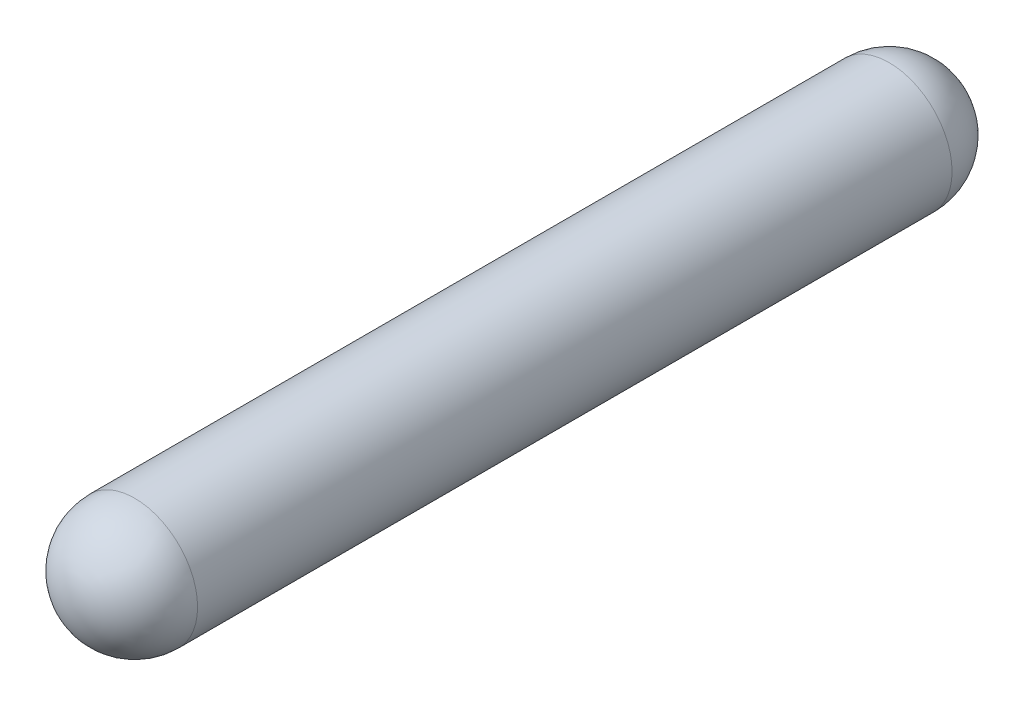
ISO-10303-21;
HEADER;
FILE_DESCRIPTION(('STEP AP214'),'2;1');
FILE_NAME('part.step','',(''),(''),'','','');
FILE_SCHEMA(('AUTOMOTIVE_DESIGN { 1 0 10303 214 1 1 1 1 }'));
ENDSEC;
DATA;
#1=APPLICATION_CONTEXT('core data for automotive mechanical design processes');
#2=APPLICATION_PROTOCOL_DEFINITION('international standard','automotive_design',2000,#1);
#3=PRODUCT_CONTEXT('',#1,'mechanical');
#4=PRODUCT('Part','Part','',(#3));
#5=PRODUCT_RELATED_PRODUCT_CATEGORY('part','',(#4));
#6=PRODUCT_DEFINITION_FORMATION('','',#4);
#7=PRODUCT_DEFINITION_CONTEXT('part definition',#1,'design');
#8=PRODUCT_DEFINITION('design','',#6,#7);
#9=PRODUCT_DEFINITION_SHAPE('','',#8);
#10=(LENGTH_UNIT() NAMED_UNIT(*) SI_UNIT(.MILLI.,.METRE.));
#11=(NAMED_UNIT(*) PLANE_ANGLE_UNIT() SI_UNIT($,.RADIAN.));
#12=(NAMED_UNIT(*) SI_UNIT($,.STERADIAN.) SOLID_ANGLE_UNIT());
#13=UNCERTAINTY_MEASURE_WITH_UNIT(LENGTH_MEASURE(1.E-05),#10,'distance_accuracy_value','');
#14=(GEOMETRIC_REPRESENTATION_CONTEXT(3) GLOBAL_UNCERTAINTY_ASSIGNED_CONTEXT((#13)) GLOBAL_UNIT_ASSIGNED_CONTEXT((#10,
#11,#12)) REPRESENTATION_CONTEXT('',''));
#15=CARTESIAN_POINT('',(0.,0.,0.));
#16=DIRECTION('',(0.,0.,1.));
#17=DIRECTION('',(1.,0.,0.));
#18=AXIS2_PLACEMENT_3D('',#15,#16,#17);
#19=CARTESIAN_POINT('',(0.,0.,-30.));
#20=DIRECTION('',(0.,0.,1.));
#21=DIRECTION('',(1.,0.,0.));
#22=AXIS2_PLACEMENT_3D('',#19,#20,#21);
#23=SPHERICAL_SURFACE('',#22,5.);
#24=CARTESIAN_POINT('',(0.,0.,-30.));
#25=DIRECTION('',(0.,0.,1.));
#26=DIRECTION('',(1.,0.,0.));
#27=AXIS2_PLACEMENT_3D('',#24,#25,#26);
#28=CIRCLE('',#27,5.);
#29=CARTESIAN_POINT('',(5.,0.,-30.));
#30=VERTEX_POINT('',#29);
#31=EDGE_CURVE('E10',#30,#30,#28,.T.);
#32=ORIENTED_EDGE('',*,*,#31,.F.);
#33=EDGE_LOOP('',(#32));
#34=FACE_BOUND('',#33,.T.);
#35=ADVANCED_FACE('F31',(#34),#23,.T.);
#36=CARTESIAN_POINT('',(0.,0.,0.));
#37=DIRECTION('',(0.,0.,1.));
#38=DIRECTION('',(1.,0.,0.));
#39=AXIS2_PLACEMENT_3D('',#36,#37,#38);
#40=CYLINDRICAL_SURFACE('',#39,5.);
#41=ORIENTED_EDGE('',*,*,#31,.T.);
#42=EDGE_LOOP('',(#41));
#43=FACE_BOUND('',#42,.T.);
#44=CARTESIAN_POINT('',(0.,0.,30.));
#45=DIRECTION('',(0.,0.,1.));
#46=DIRECTION('',(1.,0.,0.));
#47=AXIS2_PLACEMENT_3D('',#44,#45,#46);
#48=CIRCLE('',#47,5.);
#49=CARTESIAN_POINT('',(5.,0.,30.));
#50=VERTEX_POINT('',#49);
#51=EDGE_CURVE('E37',#50,#50,#48,.T.);
#52=ORIENTED_EDGE('',*,*,#51,.F.);
#53=EDGE_LOOP('',(#52));
#54=FACE_BOUND('',#53,.T.);
#55=ADVANCED_FACE('F45',(#43,#54),#40,.T.);
#56=CARTESIAN_POINT('',(0.,0.,30.));
#57=DIRECTION('',(0.,0.,-1.));
#58=DIRECTION('',(1.,0.,0.));
#59=AXIS2_PLACEMENT_3D('',#56,#57,#58);
#60=SPHERICAL_SURFACE('',#59,5.);
#61=ORIENTED_EDGE('',*,*,#51,.T.);
#62=EDGE_LOOP('',(#61));
#63=FACE_BOUND('',#62,.T.);
#64=ADVANCED_FACE('F43',(#63),#60,.T.);
#65=CLOSED_SHELL('',(#35,#55,#64));
#66=MANIFOLD_SOLID_BREP('B2',#65);
#67=ADVANCED_BREP_SHAPE_REPRESENTATION('',(#18,#66),#14);
#68=SHAPE_DEFINITION_REPRESENTATION(#9,#67);
ENDSEC;
END-ISO-10303-21;
